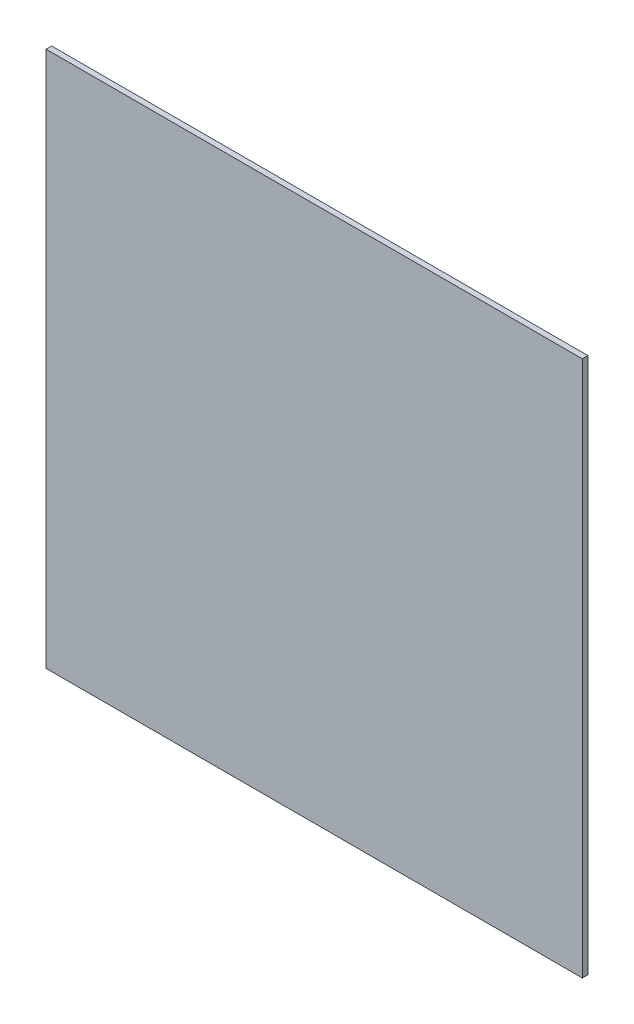
ISO-10303-21;
HEADER;
FILE_DESCRIPTION(('STEP AP214'),'2;1');
FILE_NAME('part.step','',(''),(''),'','','');
FILE_SCHEMA(('AUTOMOTIVE_DESIGN { 1 0 10303 214 1 1 1 1 }'));
ENDSEC;
DATA;
#1=APPLICATION_CONTEXT('core data for automotive mechanical design processes');
#2=APPLICATION_PROTOCOL_DEFINITION('international standard','automotive_design',2000,#1);
#3=PRODUCT_CONTEXT('',#1,'mechanical');
#4=PRODUCT('Part','Part','',(#3));
#5=PRODUCT_RELATED_PRODUCT_CATEGORY('part','',(#4));
#6=PRODUCT_DEFINITION_FORMATION('','',#4);
#7=PRODUCT_DEFINITION_CONTEXT('part definition',#1,'design');
#8=PRODUCT_DEFINITION('design','',#6,#7);
#9=PRODUCT_DEFINITION_SHAPE('','',#8);
#10=(LENGTH_UNIT() NAMED_UNIT(*) SI_UNIT(.MILLI.,.METRE.));
#11=(NAMED_UNIT(*) PLANE_ANGLE_UNIT() SI_UNIT($,.RADIAN.));
#12=(NAMED_UNIT(*) SI_UNIT($,.STERADIAN.) SOLID_ANGLE_UNIT());
#13=UNCERTAINTY_MEASURE_WITH_UNIT(LENGTH_MEASURE(1.E-05),#10,'distance_accuracy_value','');
#14=(GEOMETRIC_REPRESENTATION_CONTEXT(3) GLOBAL_UNCERTAINTY_ASSIGNED_CONTEXT((#13)) GLOBAL_UNIT_ASSIGNED_CONTEXT((#10,
#11,#12)) REPRESENTATION_CONTEXT('',''));
#15=CARTESIAN_POINT('',(0.,0.,0.));
#16=DIRECTION('',(0.,0.,1.));
#17=DIRECTION('',(1.,0.,0.));
#18=AXIS2_PLACEMENT_3D('',#15,#16,#17);
#19=CARTESIAN_POINT('',(0.,0.,6.35));
#20=DIRECTION('',(-1.,0.,0.));
#21=DIRECTION('',(0.,0.,1.));
#22=AXIS2_PLACEMENT_3D('',#19,#20,#21);
#23=PLANE('',#22);
#24=DIRECTION('',(0.,1.,0.));
#25=VECTOR('',#24,1.);
#26=CARTESIAN_POINT('',(0.,0.,0.));
#27=LINE('',#26,#25);
#28=CARTESIAN_POINT('',(0.,0.,0.));
#29=VERTEX_POINT('',#28);
#30=CARTESIAN_POINT('',(0.,609.6,0.));
#31=VERTEX_POINT('',#30);
#32=EDGE_CURVE('E110',#29,#31,#27,.T.);
#33=ORIENTED_EDGE('',*,*,#32,.T.);
#34=DIRECTION('',(0.,0.,-1.));
#35=VECTOR('',#34,1.);
#36=CARTESIAN_POINT('',(0.,609.6,6.35));
#37=LINE('',#36,#35);
#38=CARTESIAN_POINT('',(0.,609.6,6.35));
#39=VERTEX_POINT('',#38);
#40=EDGE_CURVE('E11',#39,#31,#37,.T.);
#41=ORIENTED_EDGE('',*,*,#40,.F.);
#42=DIRECTION('',(0.,1.,0.));
#43=VECTOR('',#42,1.);
#44=CARTESIAN_POINT('',(0.,0.,6.35));
#45=LINE('',#44,#43);
#46=CARTESIAN_POINT('',(0.,0.,6.35));
#47=VERTEX_POINT('',#46);
#48=EDGE_CURVE('E94',#47,#39,#45,.T.);
#49=ORIENTED_EDGE('',*,*,#48,.F.);
#50=DIRECTION('',(0.,0.,-1.));
#51=VECTOR('',#50,1.);
#52=CARTESIAN_POINT('',(0.,0.,6.35));
#53=LINE('',#52,#51);
#54=EDGE_CURVE('E106',#47,#29,#53,.T.);
#55=ORIENTED_EDGE('',*,*,#54,.T.);
#56=EDGE_LOOP('',(#33,#41,#49,#55));
#57=FACE_BOUND('',#56,.T.);
#58=ADVANCED_FACE('F42',(#57),#23,.F.);
#59=CARTESIAN_POINT('',(0.,609.6,6.35));
#60=DIRECTION('',(0.,-1.,0.));
#61=DIRECTION('',(1.,0.,0.));
#62=AXIS2_PLACEMENT_3D('',#59,#60,#61);
#63=PLANE('',#62);
#64=DIRECTION('',(-1.,0.,0.));
#65=VECTOR('',#64,1.);
#66=CARTESIAN_POINT('',(0.,609.6,0.));
#67=LINE('',#66,#65);
#68=CARTESIAN_POINT('',(-609.6,609.6,0.));
#69=VERTEX_POINT('',#68);
#70=EDGE_CURVE('E99',#31,#69,#67,.T.);
#71=ORIENTED_EDGE('',*,*,#70,.T.);
#72=DIRECTION('',(0.,0.,-1.));
#73=VECTOR('',#72,1.);
#74=CARTESIAN_POINT('',(-609.6,609.6,6.35));
#75=LINE('',#74,#73);
#76=CARTESIAN_POINT('',(-609.6,609.6,6.35));
#77=VERTEX_POINT('',#76);
#78=EDGE_CURVE('E51',#77,#69,#75,.T.);
#79=ORIENTED_EDGE('',*,*,#78,.F.);
#80=DIRECTION('',(-1.,0.,0.));
#81=VECTOR('',#80,1.);
#82=CARTESIAN_POINT('',(0.,609.6,6.35));
#83=LINE('',#82,#81);
#84=EDGE_CURVE('E89',#39,#77,#83,.T.);
#85=ORIENTED_EDGE('',*,*,#84,.F.);
#86=ORIENTED_EDGE('',*,*,#40,.T.);
#87=EDGE_LOOP('',(#71,#79,#85,#86));
#88=FACE_BOUND('',#87,.T.);
#89=ADVANCED_FACE('F98',(#88),#63,.F.);
#90=CARTESIAN_POINT('',(-609.6,0.,6.35));
#91=DIRECTION('',(1.,0.,0.));
#92=DIRECTION('',(0.,0.,-1.));
#93=AXIS2_PLACEMENT_3D('',#90,#91,#92);
#94=PLANE('',#93);
#95=DIRECTION('',(0.,-1.,0.));
#96=VECTOR('',#95,1.);
#97=CARTESIAN_POINT('',(-609.6,0.,0.));
#98=LINE('',#97,#96);
#99=CARTESIAN_POINT('',(-609.6,0.,0.));
#100=VERTEX_POINT('',#99);
#101=EDGE_CURVE('E76',#69,#100,#98,.T.);
#102=ORIENTED_EDGE('',*,*,#101,.T.);
#103=DIRECTION('',(0.,0.,-1.));
#104=VECTOR('',#103,1.);
#105=CARTESIAN_POINT('',(-609.6,0.,6.35));
#106=LINE('',#105,#104);
#107=CARTESIAN_POINT('',(-609.6,0.,6.35));
#108=VERTEX_POINT('',#107);
#109=EDGE_CURVE('E101',#108,#100,#106,.T.);
#110=ORIENTED_EDGE('',*,*,#109,.F.);
#111=DIRECTION('',(0.,-1.,0.));
#112=VECTOR('',#111,1.);
#113=CARTESIAN_POINT('',(-609.6,0.,6.35));
#114=LINE('',#113,#112);
#115=EDGE_CURVE('E92',#77,#108,#114,.T.);
#116=ORIENTED_EDGE('',*,*,#115,.F.);
#117=ORIENTED_EDGE('',*,*,#78,.T.);
#118=EDGE_LOOP('',(#102,#110,#116,#117));
#119=FACE_BOUND('',#118,.T.);
#120=ADVANCED_FACE('F102',(#119),#94,.F.);
#121=CARTESIAN_POINT('',(0.,0.,6.35));
#122=DIRECTION('',(0.,1.,0.));
#123=DIRECTION('',(-1.,0.,0.));
#124=AXIS2_PLACEMENT_3D('',#121,#122,#123);
#125=PLANE('',#124);
#126=DIRECTION('',(1.,0.,0.));
#127=VECTOR('',#126,1.);
#128=CARTESIAN_POINT('',(0.,0.,0.));
#129=LINE('',#128,#127);
#130=EDGE_CURVE('E82',#100,#29,#129,.T.);
#131=ORIENTED_EDGE('',*,*,#130,.T.);
#132=ORIENTED_EDGE('',*,*,#54,.F.);
#133=DIRECTION('',(1.,0.,0.));
#134=VECTOR('',#133,1.);
#135=CARTESIAN_POINT('',(0.,0.,6.35));
#136=LINE('',#135,#134);
#137=EDGE_CURVE('E59',#108,#47,#136,.T.);
#138=ORIENTED_EDGE('',*,*,#137,.F.);
#139=ORIENTED_EDGE('',*,*,#109,.T.);
#140=EDGE_LOOP('',(#131,#132,#138,#139));
#141=FACE_BOUND('',#140,.T.);
#142=ADVANCED_FACE('F123',(#141),#125,.F.);
#143=CARTESIAN_POINT('',(0.,0.,6.35));
#144=DIRECTION('',(0.,0.,1.));
#145=DIRECTION('',(1.,0.,0.));
#146=AXIS2_PLACEMENT_3D('',#143,#144,#145);
#147=PLANE('',#146);
#148=ORIENTED_EDGE('',*,*,#48,.T.);
#149=ORIENTED_EDGE('',*,*,#84,.T.);
#150=ORIENTED_EDGE('',*,*,#115,.T.);
#151=ORIENTED_EDGE('',*,*,#137,.T.);
#152=EDGE_LOOP('',(#148,#149,#150,#151));
#153=FACE_BOUND('',#152,.T.);
#154=ADVANCED_FACE('F90',(#153),#147,.T.);
#155=CARTESIAN_POINT('',(0.,0.,0.));
#156=DIRECTION('',(0.,0.,1.));
#157=DIRECTION('',(1.,0.,0.));
#158=AXIS2_PLACEMENT_3D('',#155,#156,#157);
#159=PLANE('',#158);
#160=ORIENTED_EDGE('',*,*,#32,.F.);
#161=ORIENTED_EDGE('',*,*,#130,.F.);
#162=ORIENTED_EDGE('',*,*,#101,.F.);
#163=ORIENTED_EDGE('',*,*,#70,.F.);
#164=EDGE_LOOP('',(#160,#161,#162,#163));
#165=FACE_BOUND('',#164,.T.);
#166=ADVANCED_FACE('F126',(#165),#159,.F.);
#167=CLOSED_SHELL('',(#58,#89,#120,#142,#154,#166));
#168=MANIFOLD_SOLID_BREP('B2',#167);
#169=ADVANCED_BREP_SHAPE_REPRESENTATION('',(#18,#168),#14);
#170=SHAPE_DEFINITION_REPRESENTATION(#9,#169);
ENDSEC;
END-ISO-10303-21;
